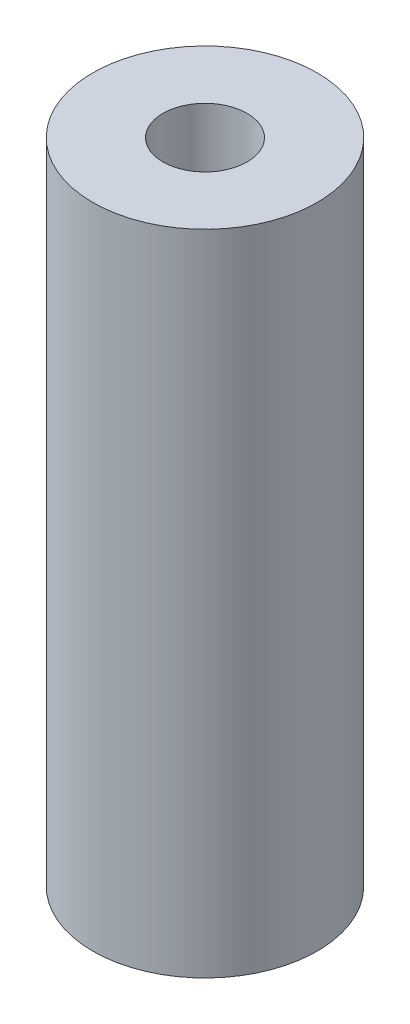
ISO-10303-21;
HEADER;
FILE_DESCRIPTION(('STEP AP214'),'2;1');
FILE_NAME('part.step','',(''),(''),'','','');
FILE_SCHEMA(('AUTOMOTIVE_DESIGN { 1 0 10303 214 1 1 1 1 }'));
ENDSEC;
DATA;
#1=APPLICATION_CONTEXT('core data for automotive mechanical design processes');
#2=APPLICATION_PROTOCOL_DEFINITION('international standard','automotive_design',2000,#1);
#3=PRODUCT_CONTEXT('',#1,'mechanical');
#4=PRODUCT('Part','Part','',(#3));
#5=PRODUCT_RELATED_PRODUCT_CATEGORY('part','',(#4));
#6=PRODUCT_DEFINITION_FORMATION('','',#4);
#7=PRODUCT_DEFINITION_CONTEXT('part definition',#1,'design');
#8=PRODUCT_DEFINITION('design','',#6,#7);
#9=PRODUCT_DEFINITION_SHAPE('','',#8);
#10=(LENGTH_UNIT() NAMED_UNIT(*) SI_UNIT(.MILLI.,.METRE.));
#11=(NAMED_UNIT(*) PLANE_ANGLE_UNIT() SI_UNIT($,.RADIAN.));
#12=(NAMED_UNIT(*) SI_UNIT($,.STERADIAN.) SOLID_ANGLE_UNIT());
#13=UNCERTAINTY_MEASURE_WITH_UNIT(LENGTH_MEASURE(1.E-05),#10,'distance_accuracy_value','');
#14=(GEOMETRIC_REPRESENTATION_CONTEXT(3) GLOBAL_UNCERTAINTY_ASSIGNED_CONTEXT((#13)) GLOBAL_UNIT_ASSIGNED_CONTEXT((#10,
#11,#12)) REPRESENTATION_CONTEXT('',''));
#15=CARTESIAN_POINT('',(0.,0.,0.));
#16=DIRECTION('',(0.,0.,1.));
#17=DIRECTION('',(1.,0.,0.));
#18=AXIS2_PLACEMENT_3D('',#15,#16,#17);
#19=CARTESIAN_POINT('',(0.,36.6776,0.));
#20=DIRECTION('',(0.,1.,0.));
#21=DIRECTION('',(0.,0.,1.));
#22=AXIS2_PLACEMENT_3D('',#19,#20,#21);
#23=PLANE('',#22);
#24=CARTESIAN_POINT('',(0.,36.6776,0.));
#25=DIRECTION('',(0.,1.,0.));
#26=DIRECTION('',(0.,0.,1.));
#27=AXIS2_PLACEMENT_3D('',#24,#25,#26);
#28=CIRCLE('',#27,12.7);
#29=CARTESIAN_POINT('',(0.,36.6776,12.7));
#30=VERTEX_POINT('',#29);
#31=EDGE_CURVE('E10',#30,#30,#28,.T.);
#32=ORIENTED_EDGE('',*,*,#31,.T.);
#33=EDGE_LOOP('',(#32));
#34=FACE_BOUND('',#33,.T.);
#35=CARTESIAN_POINT('',(0.,36.6776,0.));
#36=DIRECTION('',(0.,1.,0.));
#37=DIRECTION('',(0.,0.,1.));
#38=AXIS2_PLACEMENT_3D('',#35,#36,#37);
#39=CIRCLE('',#38,4.7625);
#40=CARTESIAN_POINT('',(0.,36.6776,4.7625));
#41=VERTEX_POINT('',#40);
#42=EDGE_CURVE('E48',#41,#41,#39,.T.);
#43=ORIENTED_EDGE('',*,*,#42,.F.);
#44=EDGE_LOOP('',(#43));
#45=FACE_BOUND('',#44,.T.);
#46=ADVANCED_FACE('F36',(#34,#45),#23,.T.);
#47=CARTESIAN_POINT('',(0.,-36.6776,0.));
#48=DIRECTION('',(0.,1.,0.));
#49=DIRECTION('',(0.,0.,1.));
#50=AXIS2_PLACEMENT_3D('',#47,#48,#49);
#51=PLANE('',#50);
#52=CARTESIAN_POINT('',(0.,-36.6776,0.));
#53=DIRECTION('',(0.,1.,0.));
#54=DIRECTION('',(0.,0.,1.));
#55=AXIS2_PLACEMENT_3D('',#52,#53,#54);
#56=CIRCLE('',#55,12.7);
#57=CARTESIAN_POINT('',(0.,-36.6776,12.7));
#58=VERTEX_POINT('',#57);
#59=EDGE_CURVE('E40',#58,#58,#56,.T.);
#60=ORIENTED_EDGE('',*,*,#59,.F.);
#61=EDGE_LOOP('',(#60));
#62=FACE_BOUND('',#61,.T.);
#63=CARTESIAN_POINT('',(0.,-36.6776,0.));
#64=DIRECTION('',(0.,1.,0.));
#65=DIRECTION('',(0.,0.,1.));
#66=AXIS2_PLACEMENT_3D('',#63,#64,#65);
#67=CIRCLE('',#66,4.7625);
#68=CARTESIAN_POINT('',(0.,-36.6776,4.7625));
#69=VERTEX_POINT('',#68);
#70=EDGE_CURVE('E50',#69,#69,#67,.T.);
#71=ORIENTED_EDGE('',*,*,#70,.T.);
#72=EDGE_LOOP('',(#71));
#73=FACE_BOUND('',#72,.T.);
#74=ADVANCED_FACE('F61',(#62,#73),#51,.F.);
#75=CARTESIAN_POINT('',(0.,36.6776,0.));
#76=DIRECTION('',(0.,-1.,0.));
#77=DIRECTION('',(0.,0.,-1.));
#78=AXIS2_PLACEMENT_3D('',#75,#76,#77);
#79=CYLINDRICAL_SURFACE('',#78,12.7);
#80=ORIENTED_EDGE('',*,*,#31,.F.);
#81=EDGE_LOOP('',(#80));
#82=FACE_BOUND('',#81,.T.);
#83=ORIENTED_EDGE('',*,*,#59,.T.);
#84=EDGE_LOOP('',(#83));
#85=FACE_BOUND('',#84,.T.);
#86=ADVANCED_FACE('F38',(#82,#85),#79,.T.);
#87=CARTESIAN_POINT('',(0.,36.6776,0.));
#88=DIRECTION('',(0.,-1.,0.));
#89=DIRECTION('',(0.,0.,-1.));
#90=AXIS2_PLACEMENT_3D('',#87,#88,#89);
#91=CYLINDRICAL_SURFACE('',#90,4.7625);
#92=ORIENTED_EDGE('',*,*,#42,.T.);
#93=EDGE_LOOP('',(#92));
#94=FACE_BOUND('',#93,.T.);
#95=ORIENTED_EDGE('',*,*,#70,.F.);
#96=EDGE_LOOP('',(#95));
#97=FACE_BOUND('',#96,.T.);
#98=ADVANCED_FACE('F57',(#94,#97),#91,.F.);
#99=CLOSED_SHELL('',(#46,#74,#86,#98));
#100=MANIFOLD_SOLID_BREP('B2',#99);
#101=ADVANCED_BREP_SHAPE_REPRESENTATION('',(#18,#100),#14);
#102=SHAPE_DEFINITION_REPRESENTATION(#9,#101);
ENDSEC;
END-ISO-10303-21;
